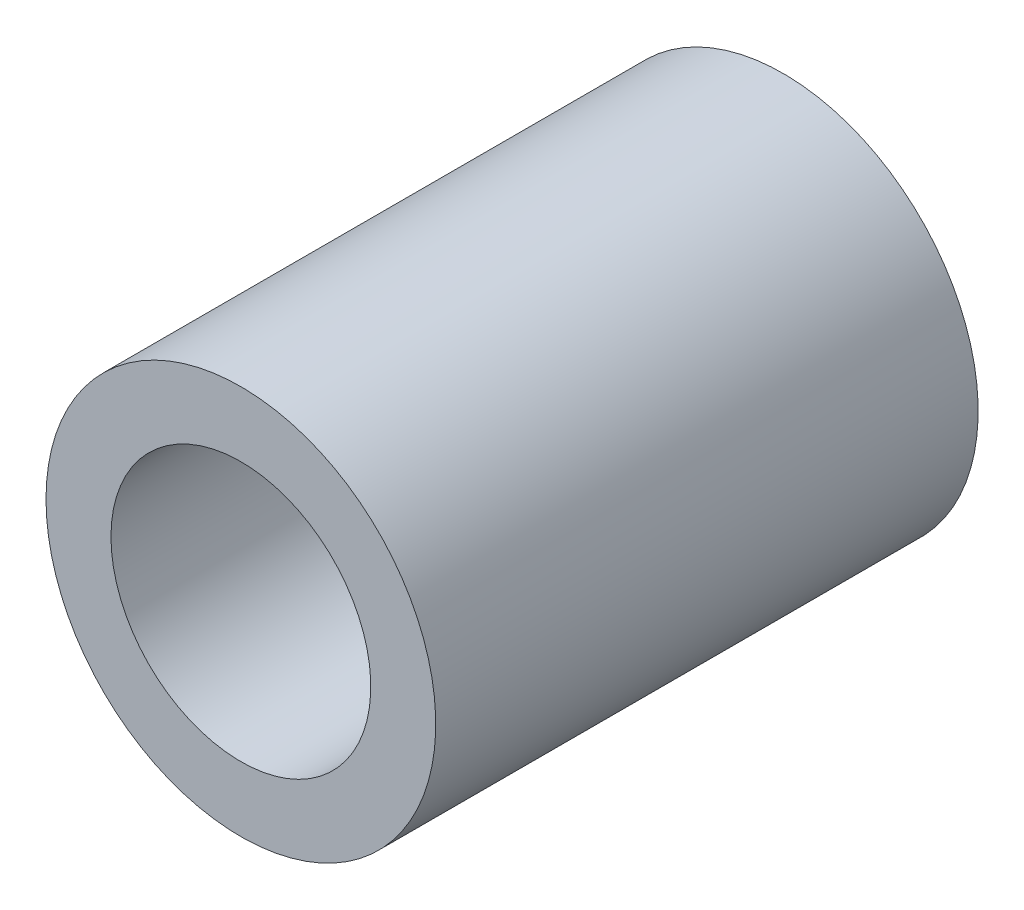
ISO-10303-21;
HEADER;
FILE_DESCRIPTION(('STEP AP214'),'2;1');
FILE_NAME('part.step','',(''),(''),'','','');
FILE_SCHEMA(('AUTOMOTIVE_DESIGN { 1 0 10303 214 1 1 1 1 }'));
ENDSEC;
DATA;
#1=APPLICATION_CONTEXT('core data for automotive mechanical design processes');
#2=APPLICATION_PROTOCOL_DEFINITION('international standard','automotive_design',2000,#1);
#3=PRODUCT_CONTEXT('',#1,'mechanical');
#4=PRODUCT('Part','Part','',(#3));
#5=PRODUCT_RELATED_PRODUCT_CATEGORY('part','',(#4));
#6=PRODUCT_DEFINITION_FORMATION('','',#4);
#7=PRODUCT_DEFINITION_CONTEXT('part definition',#1,'design');
#8=PRODUCT_DEFINITION('design','',#6,#7);
#9=PRODUCT_DEFINITION_SHAPE('','',#8);
#10=(LENGTH_UNIT() NAMED_UNIT(*) SI_UNIT(.MILLI.,.METRE.));
#11=(NAMED_UNIT(*) PLANE_ANGLE_UNIT() SI_UNIT($,.RADIAN.));
#12=(NAMED_UNIT(*) SI_UNIT($,.STERADIAN.) SOLID_ANGLE_UNIT());
#13=UNCERTAINTY_MEASURE_WITH_UNIT(LENGTH_MEASURE(1.E-05),#10,'distance_accuracy_value','');
#14=(GEOMETRIC_REPRESENTATION_CONTEXT(3) GLOBAL_UNCERTAINTY_ASSIGNED_CONTEXT((#13)) GLOBAL_UNIT_ASSIGNED_CONTEXT((#10,
#11,#12)) REPRESENTATION_CONTEXT('',''));
#15=CARTESIAN_POINT('',(0.,0.,0.));
#16=DIRECTION('',(0.,0.,1.));
#17=DIRECTION('',(1.,0.,0.));
#18=AXIS2_PLACEMENT_3D('',#15,#16,#17);
#19=CARTESIAN_POINT('',(31.63,2.,-0.01));
#20=DIRECTION('',(0.,0.,-1.));
#21=DIRECTION('',(-1.,0.,0.));
#22=AXIS2_PLACEMENT_3D('',#19,#20,#21);
#23=CYLINDRICAL_SURFACE('',#22,0.4);
#24=CARTESIAN_POINT('',(31.63,2.,1.66));
#25=DIRECTION('',(0.,0.,-1.));
#26=DIRECTION('',(-1.,0.,0.));
#27=AXIS2_PLACEMENT_3D('',#24,#25,#26);
#28=CIRCLE('',#27,0.4);
#29=CARTESIAN_POINT('',(31.23,2.,1.66));
#30=VERTEX_POINT('',#29);
#31=EDGE_CURVE('E27',#30,#30,#28,.T.);
#32=ORIENTED_EDGE('',*,*,#31,.F.);
#33=EDGE_LOOP('',(#32));
#34=FACE_BOUND('',#33,.T.);
#35=CARTESIAN_POINT('',(31.63,2.,-0.01));
#36=DIRECTION('',(0.,0.,-1.));
#37=DIRECTION('',(-1.,0.,0.));
#38=AXIS2_PLACEMENT_3D('',#35,#36,#37);
#39=CIRCLE('',#38,0.4);
#40=CARTESIAN_POINT('',(31.23,2.,-0.01));
#41=VERTEX_POINT('',#40);
#42=EDGE_CURVE('E18',#41,#41,#39,.T.);
#43=ORIENTED_EDGE('',*,*,#42,.T.);
#44=EDGE_LOOP('',(#43));
#45=FACE_BOUND('',#44,.T.);
#46=ADVANCED_FACE('F15',(#34,#45),#23,.F.);
#47=CARTESIAN_POINT('',(31.63,2.,-0.01));
#48=DIRECTION('',(0.,0.,1.));
#49=DIRECTION('',(1.,0.,0.));
#50=AXIS2_PLACEMENT_3D('',#47,#48,#49);
#51=PLANE('',#50);
#52=ORIENTED_EDGE('',*,*,#42,.F.);
#53=EDGE_LOOP('',(#52));
#54=FACE_BOUND('',#53,.T.);
#55=CARTESIAN_POINT('',(31.63,2.,-0.01));
#56=DIRECTION('',(0.,0.,-1.));
#57=DIRECTION('',(-1.,0.,0.));
#58=AXIS2_PLACEMENT_3D('',#55,#56,#57);
#59=CIRCLE('',#58,0.6);
#60=CARTESIAN_POINT('',(31.03,2.,-0.01));
#61=VERTEX_POINT('',#60);
#62=EDGE_CURVE('E22',#61,#61,#59,.F.);
#63=ORIENTED_EDGE('',*,*,#62,.F.);
#64=EDGE_LOOP('',(#63));
#65=FACE_BOUND('',#64,.T.);
#66=ADVANCED_FACE('F36',(#54,#65),#51,.F.);
#67=CARTESIAN_POINT('',(31.63,2.,1.66));
#68=DIRECTION('',(0.,0.,1.));
#69=DIRECTION('',(1.,0.,0.));
#70=AXIS2_PLACEMENT_3D('',#67,#68,#69);
#71=PLANE('',#70);
#72=ORIENTED_EDGE('',*,*,#31,.T.);
#73=EDGE_LOOP('',(#72));
#74=FACE_BOUND('',#73,.T.);
#75=CARTESIAN_POINT('',(31.63,2.,1.66));
#76=DIRECTION('',(0.,0.,-1.));
#77=DIRECTION('',(-1.,0.,0.));
#78=AXIS2_PLACEMENT_3D('',#75,#76,#77);
#79=CIRCLE('',#78,0.6);
#80=CARTESIAN_POINT('',(31.03,2.,1.66));
#81=VERTEX_POINT('',#80);
#82=EDGE_CURVE('E10',#81,#81,#79,.T.);
#83=ORIENTED_EDGE('',*,*,#82,.F.);
#84=EDGE_LOOP('',(#83));
#85=FACE_BOUND('',#84,.T.);
#86=ADVANCED_FACE('F39',(#74,#85),#71,.T.);
#87=CARTESIAN_POINT('',(31.63,2.,-0.01));
#88=DIRECTION('',(0.,0.,-1.));
#89=DIRECTION('',(-1.,0.,0.));
#90=AXIS2_PLACEMENT_3D('',#87,#88,#89);
#91=CYLINDRICAL_SURFACE('',#90,0.6);
#92=ORIENTED_EDGE('',*,*,#82,.T.);
#93=EDGE_LOOP('',(#92));
#94=FACE_BOUND('',#93,.T.);
#95=ORIENTED_EDGE('',*,*,#62,.T.);
#96=EDGE_LOOP('',(#95));
#97=FACE_BOUND('',#96,.T.);
#98=ADVANCED_FACE('F42',(#94,#97),#91,.T.);
#99=CLOSED_SHELL('',(#46,#66,#86,#98));
#100=MANIFOLD_SOLID_BREP('B1',#99);
#101=ADVANCED_BREP_SHAPE_REPRESENTATION('',(#18,#100),#14);
#102=SHAPE_DEFINITION_REPRESENTATION(#9,#101);
ENDSEC;
END-ISO-10303-21;
